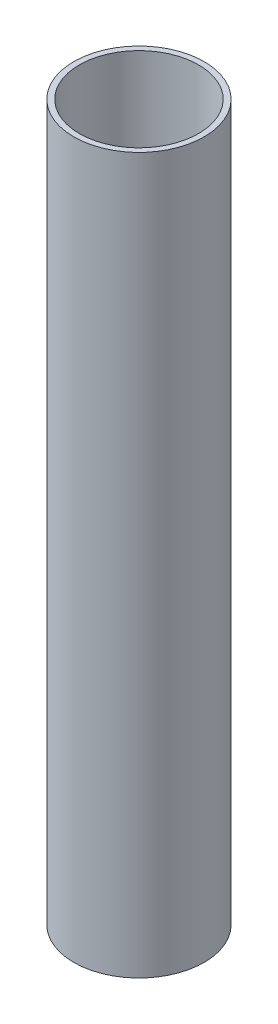
ISO-10303-21;
HEADER;
FILE_DESCRIPTION(('STEP AP214'),'2;1');
FILE_NAME('part.step','',(''),(''),'','','');
FILE_SCHEMA(('AUTOMOTIVE_DESIGN { 1 0 10303 214 1 1 1 1 }'));
ENDSEC;
DATA;
#1=APPLICATION_CONTEXT('core data for automotive mechanical design processes');
#2=APPLICATION_PROTOCOL_DEFINITION('international standard','automotive_design',2000,#1);
#3=PRODUCT_CONTEXT('',#1,'mechanical');
#4=PRODUCT('Part','Part','',(#3));
#5=PRODUCT_RELATED_PRODUCT_CATEGORY('part','',(#4));
#6=PRODUCT_DEFINITION_FORMATION('','',#4);
#7=PRODUCT_DEFINITION_CONTEXT('part definition',#1,'design');
#8=PRODUCT_DEFINITION('design','',#6,#7);
#9=PRODUCT_DEFINITION_SHAPE('','',#8);
#10=(LENGTH_UNIT() NAMED_UNIT(*) SI_UNIT(.MILLI.,.METRE.));
#11=(NAMED_UNIT(*) PLANE_ANGLE_UNIT() SI_UNIT($,.RADIAN.));
#12=(NAMED_UNIT(*) SI_UNIT($,.STERADIAN.) SOLID_ANGLE_UNIT());
#13=UNCERTAINTY_MEASURE_WITH_UNIT(LENGTH_MEASURE(1.E-05),#10,'distance_accuracy_value','');
#14=(GEOMETRIC_REPRESENTATION_CONTEXT(3) GLOBAL_UNCERTAINTY_ASSIGNED_CONTEXT((#13)) GLOBAL_UNIT_ASSIGNED_CONTEXT((#10,
#11,#12)) REPRESENTATION_CONTEXT('',''));
#15=CARTESIAN_POINT('',(0.,0.,0.));
#16=DIRECTION('',(0.,0.,1.));
#17=DIRECTION('',(1.,0.,0.));
#18=AXIS2_PLACEMENT_3D('',#15,#16,#17);
#19=CARTESIAN_POINT('',(0.,457.2,0.));
#20=DIRECTION('',(0.,1.,0.));
#21=DIRECTION('',(0.,0.,1.));
#22=AXIS2_PLACEMENT_3D('',#19,#20,#21);
#23=PLANE('',#22);
#24=CARTESIAN_POINT('',(0.,457.2,0.));
#25=DIRECTION('',(0.,1.,0.));
#26=DIRECTION('',(0.,0.,1.));
#27=AXIS2_PLACEMENT_3D('',#24,#25,#26);
#28=CIRCLE('',#27,41.6814);
#29=CARTESIAN_POINT('',(0.,457.2,41.6814));
#30=VERTEX_POINT('',#29);
#31=EDGE_CURVE('E10',#30,#30,#28,.T.);
#32=ORIENTED_EDGE('',*,*,#31,.T.);
#33=EDGE_LOOP('',(#32));
#34=FACE_BOUND('',#33,.T.);
#35=CARTESIAN_POINT('',(0.,457.2,0.));
#36=DIRECTION('',(0.,1.,0.));
#37=DIRECTION('',(0.,0.,1.));
#38=AXIS2_PLACEMENT_3D('',#35,#36,#37);
#39=CIRCLE('',#38,38.1);
#40=CARTESIAN_POINT('',(0.,457.2,38.1));
#41=VERTEX_POINT('',#40);
#42=EDGE_CURVE('E49',#41,#41,#39,.T.);
#43=ORIENTED_EDGE('',*,*,#42,.F.);
#44=EDGE_LOOP('',(#43));
#45=FACE_BOUND('',#44,.T.);
#46=ADVANCED_FACE('F35',(#34,#45),#23,.T.);
#47=CARTESIAN_POINT('',(0.,0.,0.));
#48=DIRECTION('',(0.,1.,0.));
#49=DIRECTION('',(0.,0.,1.));
#50=AXIS2_PLACEMENT_3D('',#47,#48,#49);
#51=PLANE('',#50);
#52=CARTESIAN_POINT('',(0.,0.,0.));
#53=DIRECTION('',(0.,1.,0.));
#54=DIRECTION('',(0.,0.,1.));
#55=AXIS2_PLACEMENT_3D('',#52,#53,#54);
#56=CIRCLE('',#55,41.6814);
#57=CARTESIAN_POINT('',(0.,0.,41.6814));
#58=VERTEX_POINT('',#57);
#59=EDGE_CURVE('E39',#58,#58,#56,.T.);
#60=ORIENTED_EDGE('',*,*,#59,.F.);
#61=EDGE_LOOP('',(#60));
#62=FACE_BOUND('',#61,.T.);
#63=CARTESIAN_POINT('',(0.,0.,0.));
#64=DIRECTION('',(0.,1.,0.));
#65=DIRECTION('',(0.,0.,1.));
#66=AXIS2_PLACEMENT_3D('',#63,#64,#65);
#67=CIRCLE('',#66,38.1);
#68=CARTESIAN_POINT('',(0.,0.,38.1));
#69=VERTEX_POINT('',#68);
#70=EDGE_CURVE('E51',#69,#69,#67,.T.);
#71=ORIENTED_EDGE('',*,*,#70,.T.);
#72=EDGE_LOOP('',(#71));
#73=FACE_BOUND('',#72,.T.);
#74=ADVANCED_FACE('F62',(#62,#73),#51,.F.);
#75=CARTESIAN_POINT('',(0.,457.2,0.));
#76=DIRECTION('',(0.,-1.,0.));
#77=DIRECTION('',(0.,0.,-1.));
#78=AXIS2_PLACEMENT_3D('',#75,#76,#77);
#79=CYLINDRICAL_SURFACE('',#78,41.6814);
#80=ORIENTED_EDGE('',*,*,#31,.F.);
#81=EDGE_LOOP('',(#80));
#82=FACE_BOUND('',#81,.T.);
#83=ORIENTED_EDGE('',*,*,#59,.T.);
#84=EDGE_LOOP('',(#83));
#85=FACE_BOUND('',#84,.T.);
#86=ADVANCED_FACE('F37',(#82,#85),#79,.T.);
#87=CARTESIAN_POINT('',(0.,457.2,0.));
#88=DIRECTION('',(0.,-1.,0.));
#89=DIRECTION('',(0.,0.,-1.));
#90=AXIS2_PLACEMENT_3D('',#87,#88,#89);
#91=CYLINDRICAL_SURFACE('',#90,38.1);
#92=ORIENTED_EDGE('',*,*,#42,.T.);
#93=EDGE_LOOP('',(#92));
#94=FACE_BOUND('',#93,.T.);
#95=ORIENTED_EDGE('',*,*,#70,.F.);
#96=EDGE_LOOP('',(#95));
#97=FACE_BOUND('',#96,.T.);
#98=ADVANCED_FACE('F58',(#94,#97),#91,.F.);
#99=CLOSED_SHELL('',(#46,#74,#86,#98));
#100=MANIFOLD_SOLID_BREP('B2',#99);
#101=ADVANCED_BREP_SHAPE_REPRESENTATION('',(#18,#100),#14);
#102=SHAPE_DEFINITION_REPRESENTATION(#9,#101);
ENDSEC;
END-ISO-10303-21;
